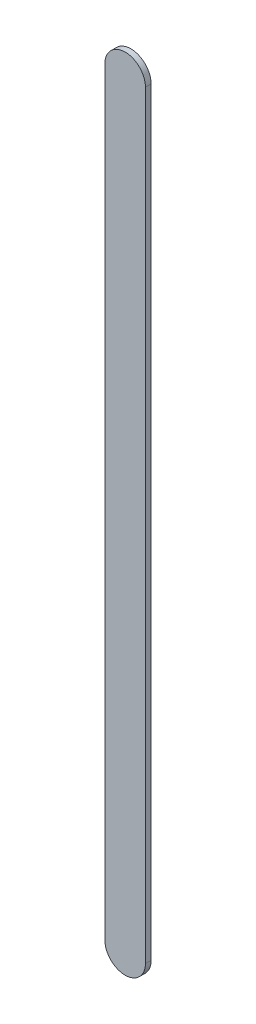
ISO-10303-21;
HEADER;
FILE_DESCRIPTION(('STEP AP214'),'2;1');
FILE_NAME('part.step','',(''),(''),'','','');
FILE_SCHEMA(('AUTOMOTIVE_DESIGN { 1 0 10303 214 1 1 1 1 }'));
ENDSEC;
DATA;
#1=APPLICATION_CONTEXT('core data for automotive mechanical design processes');
#2=APPLICATION_PROTOCOL_DEFINITION('international standard','automotive_design',2000,#1);
#3=PRODUCT_CONTEXT('',#1,'mechanical');
#4=PRODUCT('Part','Part','',(#3));
#5=PRODUCT_RELATED_PRODUCT_CATEGORY('part','',(#4));
#6=PRODUCT_DEFINITION_FORMATION('','',#4);
#7=PRODUCT_DEFINITION_CONTEXT('part definition',#1,'design');
#8=PRODUCT_DEFINITION('design','',#6,#7);
#9=PRODUCT_DEFINITION_SHAPE('','',#8);
#10=(LENGTH_UNIT() NAMED_UNIT(*) SI_UNIT(.MILLI.,.METRE.));
#11=(NAMED_UNIT(*) PLANE_ANGLE_UNIT() SI_UNIT($,.RADIAN.));
#12=(NAMED_UNIT(*) SI_UNIT($,.STERADIAN.) SOLID_ANGLE_UNIT());
#13=UNCERTAINTY_MEASURE_WITH_UNIT(LENGTH_MEASURE(1.E-05),#10,'distance_accuracy_value','');
#14=(GEOMETRIC_REPRESENTATION_CONTEXT(3) GLOBAL_UNCERTAINTY_ASSIGNED_CONTEXT((#13)) GLOBAL_UNIT_ASSIGNED_CONTEXT((#10,
#11,#12)) REPRESENTATION_CONTEXT('',''));
#15=CARTESIAN_POINT('',(0.,0.,0.));
#16=DIRECTION('',(0.,0.,1.));
#17=DIRECTION('',(1.,0.,0.));
#18=AXIS2_PLACEMENT_3D('',#15,#16,#17);
#19=CARTESIAN_POINT('',(85.14397246,71.93576164,0.));
#20=DIRECTION('',(-1.,0.,0.));
#21=DIRECTION('',(0.,1.,0.));
#22=AXIS2_PLACEMENT_3D('',#19,#20,#21);
#23=PLANE('',#22);
#24=DIRECTION('',(0.,1.,0.));
#25=VECTOR('',#24,1.);
#26=CARTESIAN_POINT('',(85.14397246,71.93576164,0.03556));
#27=LINE('',#26,#25);
#28=CARTESIAN_POINT('',(85.14397246,71.93576164,0.03556));
#29=VERTEX_POINT('',#28);
#30=CARTESIAN_POINT('',(85.14397246,76.68697388,0.03556));
#31=VERTEX_POINT('',#30);
#32=EDGE_CURVE('E11',#29,#31,#27,.T.);
#33=ORIENTED_EDGE('',*,*,#32,.F.);
#34=DIRECTION('',(0.,0.,1.));
#35=VECTOR('',#34,1.);
#36=CARTESIAN_POINT('',(85.14397246,71.93576164,0.));
#37=LINE('',#36,#35);
#38=CARTESIAN_POINT('',(85.14397246,71.93576164,0.));
#39=VERTEX_POINT('',#38);
#40=EDGE_CURVE('E24',#39,#29,#37,.T.);
#41=ORIENTED_EDGE('',*,*,#40,.F.);
#42=DIRECTION('',(0.,1.,0.));
#43=VECTOR('',#42,1.);
#44=CARTESIAN_POINT('',(85.14397246,71.93576164,0.));
#45=LINE('',#44,#43);
#46=CARTESIAN_POINT('',(85.14397246,76.68697388,0.));
#47=VERTEX_POINT('',#46);
#48=EDGE_CURVE('E75',#39,#47,#45,.T.);
#49=ORIENTED_EDGE('',*,*,#48,.T.);
#50=DIRECTION('',(0.,0.,1.));
#51=VECTOR('',#50,1.);
#52=CARTESIAN_POINT('',(85.14397246,76.68697388,0.));
#53=LINE('',#52,#51);
#54=EDGE_CURVE('E37',#47,#31,#53,.T.);
#55=ORIENTED_EDGE('',*,*,#54,.T.);
#56=EDGE_LOOP('',(#33,#41,#49,#55));
#57=FACE_BOUND('',#56,.T.);
#58=ADVANCED_FACE('F17',(#57),#23,.F.);
#59=CARTESIAN_POINT('',(85.01697246,76.68697388,0.));
#60=DIRECTION('',(0.,0.,-1.));
#61=DIRECTION('',(1.,1.11896493820492E-13,0.));
#62=AXIS2_PLACEMENT_3D('',#59,#60,#61);
#63=CYLINDRICAL_SURFACE('',#62,0.127000000000005);
#64=CARTESIAN_POINT('',(85.01697246,76.68697388,0.03556));
#65=DIRECTION('',(0.,0.,1.));
#66=DIRECTION('',(1.,1.11896493820492E-13,0.));
#67=AXIS2_PLACEMENT_3D('',#64,#65,#66);
#68=CIRCLE('',#67,0.127000000000005);
#69=CARTESIAN_POINT('',(84.88997246,76.68697388,0.03556));
#70=VERTEX_POINT('',#69);
#71=EDGE_CURVE('E83',#31,#70,#68,.T.);
#72=ORIENTED_EDGE('',*,*,#71,.F.);
#73=ORIENTED_EDGE('',*,*,#54,.F.);
#74=CARTESIAN_POINT('',(85.01697246,76.68697388,0.));
#75=DIRECTION('',(0.,0.,1.));
#76=DIRECTION('',(1.,1.11896493820492E-13,0.));
#77=AXIS2_PLACEMENT_3D('',#74,#75,#76);
#78=CIRCLE('',#77,0.127000000000005);
#79=CARTESIAN_POINT('',(84.88997246,76.68697388,0.));
#80=VERTEX_POINT('',#79);
#81=EDGE_CURVE('E81',#47,#80,#78,.T.);
#82=ORIENTED_EDGE('',*,*,#81,.T.);
#83=DIRECTION('',(0.,0.,1.));
#84=VECTOR('',#83,1.);
#85=CARTESIAN_POINT('',(84.88997246,76.68697388,0.));
#86=LINE('',#85,#84);
#87=EDGE_CURVE('E67',#80,#70,#86,.T.);
#88=ORIENTED_EDGE('',*,*,#87,.T.);
#89=EDGE_LOOP('',(#72,#73,#82,#88));
#90=FACE_BOUND('',#89,.T.);
#91=ADVANCED_FACE('F89',(#90),#63,.T.);
#92=CARTESIAN_POINT('',(84.88997246,76.68697388,0.));
#93=DIRECTION('',(1.,0.,0.));
#94=DIRECTION('',(0.,-1.,0.));
#95=AXIS2_PLACEMENT_3D('',#92,#93,#94);
#96=PLANE('',#95);
#97=DIRECTION('',(0.,-1.,0.));
#98=VECTOR('',#97,1.);
#99=CARTESIAN_POINT('',(84.88997246,76.68697388,0.03556));
#100=LINE('',#99,#98);
#101=CARTESIAN_POINT('',(84.88997246,71.93576164,0.03556));
#102=VERTEX_POINT('',#101);
#103=EDGE_CURVE('E71',#70,#102,#100,.T.);
#104=ORIENTED_EDGE('',*,*,#103,.F.);
#105=ORIENTED_EDGE('',*,*,#87,.F.);
#106=DIRECTION('',(0.,-1.,0.));
#107=VECTOR('',#106,1.);
#108=CARTESIAN_POINT('',(84.88997246,76.68697388,0.));
#109=LINE('',#108,#107);
#110=CARTESIAN_POINT('',(84.88997246,71.93576164,0.));
#111=VERTEX_POINT('',#110);
#112=EDGE_CURVE('E63',#80,#111,#109,.T.);
#113=ORIENTED_EDGE('',*,*,#112,.T.);
#114=DIRECTION('',(0.,0.,1.));
#115=VECTOR('',#114,1.);
#116=CARTESIAN_POINT('',(84.88997246,71.93576164,0.));
#117=LINE('',#116,#115);
#118=EDGE_CURVE('E53',#111,#102,#117,.T.);
#119=ORIENTED_EDGE('',*,*,#118,.T.);
#120=EDGE_LOOP('',(#104,#105,#113,#119));
#121=FACE_BOUND('',#120,.T.);
#122=ADVANCED_FACE('F66',(#121),#96,.F.);
#123=CARTESIAN_POINT('',(85.01697246,71.93576164,0.));
#124=DIRECTION('',(0.,0.,-1.));
#125=DIRECTION('',(-1.,-1.1189649382048E-13,0.));
#126=AXIS2_PLACEMENT_3D('',#123,#124,#125);
#127=CYLINDRICAL_SURFACE('',#126,0.127000000000005);
#128=CARTESIAN_POINT('',(85.01697246,71.93576164,0.03556));
#129=DIRECTION('',(0.,0.,1.));
#130=DIRECTION('',(-1.,-1.1189649382048E-13,0.));
#131=AXIS2_PLACEMENT_3D('',#128,#129,#130);
#132=CIRCLE('',#131,0.127000000000005);
#133=EDGE_CURVE('E59',#102,#29,#132,.T.);
#134=ORIENTED_EDGE('',*,*,#133,.F.);
#135=ORIENTED_EDGE('',*,*,#118,.F.);
#136=CARTESIAN_POINT('',(85.01697246,71.93576164,0.));
#137=DIRECTION('',(0.,0.,1.));
#138=DIRECTION('',(-1.,-1.1189649382048E-13,0.));
#139=AXIS2_PLACEMENT_3D('',#136,#137,#138);
#140=CIRCLE('',#139,0.127000000000005);
#141=EDGE_CURVE('E57',#111,#39,#140,.T.);
#142=ORIENTED_EDGE('',*,*,#141,.T.);
#143=ORIENTED_EDGE('',*,*,#40,.T.);
#144=EDGE_LOOP('',(#134,#135,#142,#143));
#145=FACE_BOUND('',#144,.T.);
#146=ADVANCED_FACE('F55',(#145),#127,.T.);
#147=CARTESIAN_POINT('',(85.14397246,71.93576164,0.));
#148=DIRECTION('',(0.,0.,-1.));
#149=DIRECTION('',(-1.,0.,0.));
#150=AXIS2_PLACEMENT_3D('',#147,#148,#149);
#151=PLANE('',#150);
#152=ORIENTED_EDGE('',*,*,#141,.F.);
#153=ORIENTED_EDGE('',*,*,#112,.F.);
#154=ORIENTED_EDGE('',*,*,#81,.F.);
#155=ORIENTED_EDGE('',*,*,#48,.F.);
#156=EDGE_LOOP('',(#152,#153,#154,#155));
#157=FACE_BOUND('',#156,.T.);
#158=ADVANCED_FACE('F74',(#157),#151,.T.);
#159=CARTESIAN_POINT('',(85.14397246,71.93576164,0.03556));
#160=DIRECTION('',(0.,0.,-1.));
#161=DIRECTION('',(-1.,0.,0.));
#162=AXIS2_PLACEMENT_3D('',#159,#160,#161);
#163=PLANE('',#162);
#164=ORIENTED_EDGE('',*,*,#32,.T.);
#165=ORIENTED_EDGE('',*,*,#71,.T.);
#166=ORIENTED_EDGE('',*,*,#103,.T.);
#167=ORIENTED_EDGE('',*,*,#133,.T.);
#168=EDGE_LOOP('',(#164,#165,#166,#167));
#169=FACE_BOUND('',#168,.T.);
#170=ADVANCED_FACE('F91',(#169),#163,.F.);
#171=CLOSED_SHELL('',(#58,#91,#122,#146,#158,#170));
#172=MANIFOLD_SOLID_BREP('B1',#171);
#173=ADVANCED_BREP_SHAPE_REPRESENTATION('',(#18,#172),#14);
#174=SHAPE_DEFINITION_REPRESENTATION(#9,#173);
ENDSEC;
END-ISO-10303-21;
